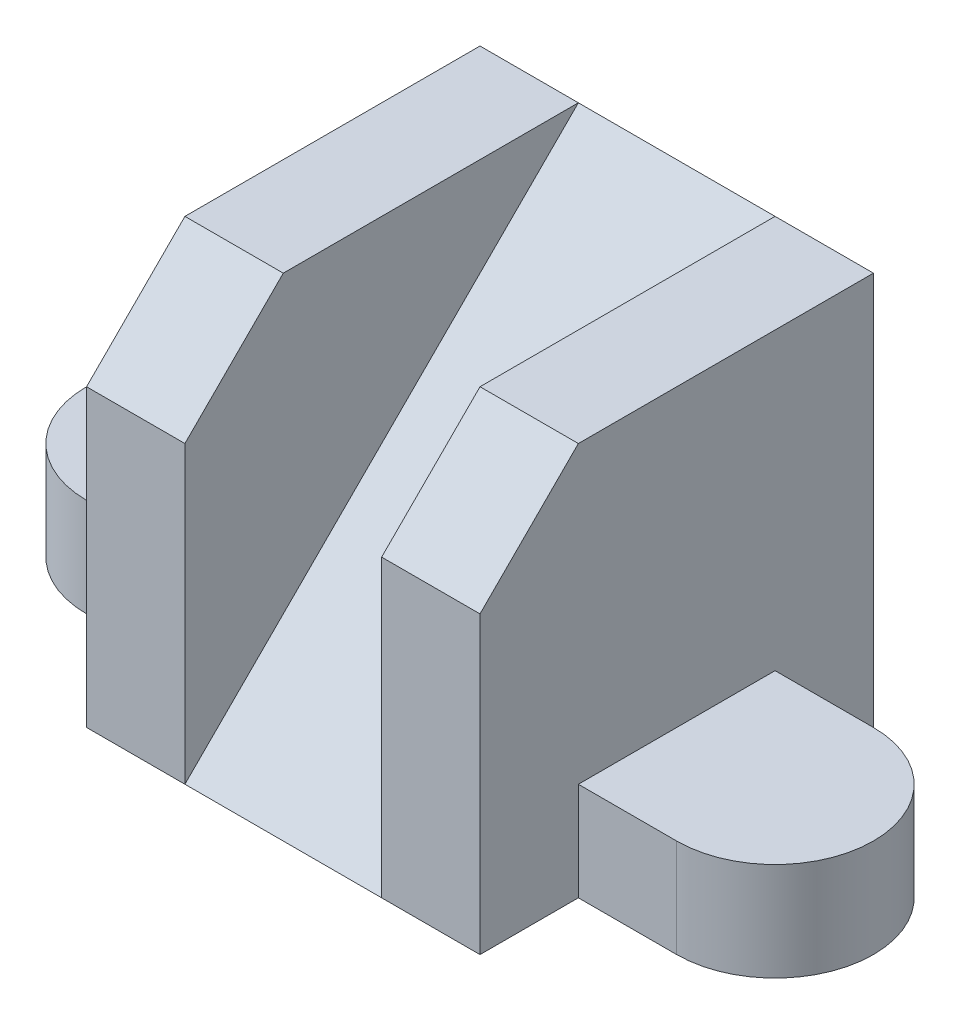
ISO-10303-21;
HEADER;
FILE_DESCRIPTION(('STEP AP214'),'2;1');
FILE_NAME('part.step','',(''),(''),'','','');
FILE_SCHEMA(('AUTOMOTIVE_DESIGN { 1 0 10303 214 1 1 1 1 }'));
ENDSEC;
DATA;
#1=APPLICATION_CONTEXT('core data for automotive mechanical design processes');
#2=APPLICATION_PROTOCOL_DEFINITION('international standard','automotive_design',2000,#1);
#3=PRODUCT_CONTEXT('',#1,'mechanical');
#4=PRODUCT('Part','Part','',(#3));
#5=PRODUCT_RELATED_PRODUCT_CATEGORY('part','',(#4));
#6=PRODUCT_DEFINITION_FORMATION('','',#4);
#7=PRODUCT_DEFINITION_CONTEXT('part definition',#1,'design');
#8=PRODUCT_DEFINITION('design','',#6,#7);
#9=PRODUCT_DEFINITION_SHAPE('','',#8);
#10=(LENGTH_UNIT() NAMED_UNIT(*) SI_UNIT(.MILLI.,.METRE.));
#11=(NAMED_UNIT(*) PLANE_ANGLE_UNIT() SI_UNIT($,.RADIAN.));
#12=(NAMED_UNIT(*) SI_UNIT($,.STERADIAN.) SOLID_ANGLE_UNIT());
#13=UNCERTAINTY_MEASURE_WITH_UNIT(LENGTH_MEASURE(1.E-05),#10,'distance_accuracy_value','');
#14=(GEOMETRIC_REPRESENTATION_CONTEXT(3) GLOBAL_UNCERTAINTY_ASSIGNED_CONTEXT((#13)) GLOBAL_UNIT_ASSIGNED_CONTEXT((#10,
#11,#12)) REPRESENTATION_CONTEXT('',''));
#15=CARTESIAN_POINT('',(0.,0.,0.));
#16=DIRECTION('',(0.,0.,1.));
#17=DIRECTION('',(1.,0.,0.));
#18=AXIS2_PLACEMENT_3D('',#15,#16,#17);
#19=CARTESIAN_POINT('',(14.,0.,0.));
#20=DIRECTION('',(-1.,0.,0.));
#21=DIRECTION('',(0.,0.,1.));
#22=AXIS2_PLACEMENT_3D('',#19,#20,#21);
#23=PLANE('',#22);
#24=DIRECTION('',(0.,-1.,0.));
#25=VECTOR('',#24,1.);
#26=CARTESIAN_POINT('',(14.,7.,7.));
#27=LINE('',#26,#25);
#28=CARTESIAN_POINT('',(14.,7.,7.));
#29=VERTEX_POINT('',#28);
#30=CARTESIAN_POINT('',(14.,0.,7.));
#31=VERTEX_POINT('',#30);
#32=EDGE_CURVE('E179',#29,#31,#27,.T.);
#33=ORIENTED_EDGE('',*,*,#32,.F.);
#34=DIRECTION('',(0.,0.,1.));
#35=VECTOR('',#34,1.);
#36=CARTESIAN_POINT('',(14.,7.,-7.));
#37=LINE('',#36,#35);
#38=CARTESIAN_POINT('',(14.,7.,-7.));
#39=VERTEX_POINT('',#38);
#40=EDGE_CURVE('E160',#39,#29,#37,.T.);
#41=ORIENTED_EDGE('',*,*,#40,.F.);
#42=DIRECTION('',(0.,-1.,0.));
#43=VECTOR('',#42,1.);
#44=CARTESIAN_POINT('',(14.,7.,-7.));
#45=LINE('',#44,#43);
#46=CARTESIAN_POINT('',(14.,0.,-7.));
#47=VERTEX_POINT('',#46);
#48=EDGE_CURVE('E157',#39,#47,#45,.T.);
#49=ORIENTED_EDGE('',*,*,#48,.T.);
#50=DIRECTION('',(0.,0.,-1.));
#51=VECTOR('',#50,1.);
#52=CARTESIAN_POINT('',(14.,0.,-14.));
#53=LINE('',#52,#51);
#54=CARTESIAN_POINT('',(14.,0.,-14.));
#55=VERTEX_POINT('',#54);
#56=EDGE_CURVE('E236',#47,#55,#53,.T.);
#57=ORIENTED_EDGE('',*,*,#56,.T.);
#58=DIRECTION('',(0.,1.,0.));
#59=VECTOR('',#58,1.);
#60=CARTESIAN_POINT('',(14.,28.,-14.));
#61=LINE('',#60,#59);
#62=CARTESIAN_POINT('',(14.,28.,-14.));
#63=VERTEX_POINT('',#62);
#64=EDGE_CURVE('E240',#55,#63,#61,.T.);
#65=ORIENTED_EDGE('',*,*,#64,.T.);
#66=DIRECTION('',(0.,0.,1.));
#67=VECTOR('',#66,1.);
#68=CARTESIAN_POINT('',(14.,28.,7.));
#69=LINE('',#68,#67);
#70=CARTESIAN_POINT('',(14.,28.,7.));
#71=VERTEX_POINT('',#70);
#72=EDGE_CURVE('E242',#63,#71,#69,.T.);
#73=ORIENTED_EDGE('',*,*,#72,.T.);
#74=DIRECTION('',(0.,-0.707106781186547,0.707106781186548));
#75=VECTOR('',#74,1.);
#76=CARTESIAN_POINT('',(14.,21.,14.));
#77=LINE('',#76,#75);
#78=CARTESIAN_POINT('',(14.,21.,14.));
#79=VERTEX_POINT('',#78);
#80=EDGE_CURVE('E230',#71,#79,#77,.T.);
#81=ORIENTED_EDGE('',*,*,#80,.T.);
#82=DIRECTION('',(0.,-1.,0.));
#83=VECTOR('',#82,1.);
#84=CARTESIAN_POINT('',(14.,0.,14.));
#85=LINE('',#84,#83);
#86=CARTESIAN_POINT('',(14.,0.,14.));
#87=VERTEX_POINT('',#86);
#88=EDGE_CURVE('E233',#79,#87,#85,.T.);
#89=ORIENTED_EDGE('',*,*,#88,.T.);
#90=EDGE_CURVE('E237',#87,#31,#53,.T.);
#91=ORIENTED_EDGE('',*,*,#90,.T.);
#92=EDGE_LOOP('',(#33,#41,#49,#57,#65,#73,#81,#89,#91));
#93=FACE_BOUND('',#92,.T.);
#94=ADVANCED_FACE('F33',(#93),#23,.F.);
#95=CARTESIAN_POINT('',(14.,21.,14.));
#96=DIRECTION('',(0.,-0.707106781186548,-0.707106781186548));
#97=DIRECTION('',(0.,0.707106781186547,-0.707106781186548));
#98=AXIS2_PLACEMENT_3D('',#95,#96,#97);
#99=PLANE('',#98);
#100=DIRECTION('',(0.,0.707106781186547,-0.707106781186548));
#101=VECTOR('',#100,1.);
#102=CARTESIAN_POINT('',(7.,21.,14.));
#103=LINE('',#102,#101);
#104=CARTESIAN_POINT('',(7.,21.,14.));
#105=VERTEX_POINT('',#104);
#106=CARTESIAN_POINT('',(7.,28.,7.));
#107=VERTEX_POINT('',#106);
#108=EDGE_CURVE('E223',#105,#107,#103,.T.);
#109=ORIENTED_EDGE('',*,*,#108,.F.);
#110=DIRECTION('',(-1.,0.,0.));
#111=VECTOR('',#110,1.);
#112=CARTESIAN_POINT('',(14.,21.,14.));
#113=LINE('',#112,#111);
#114=EDGE_CURVE('E11',#79,#105,#113,.T.);
#115=ORIENTED_EDGE('',*,*,#114,.F.);
#116=ORIENTED_EDGE('',*,*,#80,.F.);
#117=DIRECTION('',(-1.,0.,0.));
#118=VECTOR('',#117,1.);
#119=CARTESIAN_POINT('',(14.,28.,7.));
#120=LINE('',#119,#118);
#121=EDGE_CURVE('E259',#71,#107,#120,.T.);
#122=ORIENTED_EDGE('',*,*,#121,.T.);
#123=EDGE_LOOP('',(#109,#115,#116,#122));
#124=FACE_BOUND('',#123,.T.);
#125=ADVANCED_FACE('F332',(#124),#99,.F.);
#126=CARTESIAN_POINT('',(14.,0.,14.));
#127=DIRECTION('',(0.,0.,-1.));
#128=DIRECTION('',(-1.,0.,0.));
#129=AXIS2_PLACEMENT_3D('',#126,#127,#128);
#130=PLANE('',#129);
#131=DIRECTION('',(0.,-1.,0.));
#132=VECTOR('',#131,1.);
#133=CARTESIAN_POINT('',(7.,28.,14.));
#134=LINE('',#133,#132);
#135=CARTESIAN_POINT('',(7.,0.,14.));
#136=VERTEX_POINT('',#135);
#137=EDGE_CURVE('E204',#105,#136,#134,.T.);
#138=ORIENTED_EDGE('',*,*,#137,.T.);
#139=DIRECTION('',(-1.,0.,0.));
#140=VECTOR('',#139,1.);
#141=CARTESIAN_POINT('',(14.,0.,14.));
#142=LINE('',#141,#140);
#143=EDGE_CURVE('E269',#87,#136,#142,.T.);
#144=ORIENTED_EDGE('',*,*,#143,.F.);
#145=ORIENTED_EDGE('',*,*,#88,.F.);
#146=ORIENTED_EDGE('',*,*,#114,.T.);
#147=EDGE_LOOP('',(#138,#144,#145,#146));
#148=FACE_BOUND('',#147,.T.);
#149=ADVANCED_FACE('F325',(#148),#130,.F.);
#150=CARTESIAN_POINT('',(14.,28.,7.));
#151=DIRECTION('',(0.,-1.,0.));
#152=DIRECTION('',(0.,0.,-1.));
#153=AXIS2_PLACEMENT_3D('',#150,#151,#152);
#154=PLANE('',#153);
#155=DIRECTION('',(0.,0.,1.));
#156=VECTOR('',#155,1.);
#157=CARTESIAN_POINT('',(7.,28.,-14.));
#158=LINE('',#157,#156);
#159=CARTESIAN_POINT('',(7.,28.,-14.));
#160=VERTEX_POINT('',#159);
#161=EDGE_CURVE('E208',#160,#107,#158,.T.);
#162=ORIENTED_EDGE('',*,*,#161,.T.);
#163=ORIENTED_EDGE('',*,*,#121,.F.);
#164=ORIENTED_EDGE('',*,*,#72,.F.);
#165=DIRECTION('',(-1.,0.,0.));
#166=VECTOR('',#165,1.);
#167=CARTESIAN_POINT('',(14.,28.,-14.));
#168=LINE('',#167,#166);
#169=EDGE_CURVE('E263',#63,#160,#168,.T.);
#170=ORIENTED_EDGE('',*,*,#169,.T.);
#171=EDGE_LOOP('',(#162,#163,#164,#170));
#172=FACE_BOUND('',#171,.T.);
#173=ADVANCED_FACE('F336',(#172),#154,.F.);
#174=CARTESIAN_POINT('',(-7.,21.,14.));
#175=VERTEX_POINT('',#174);
#176=CARTESIAN_POINT('',(-14.,21.,14.));
#177=VERTEX_POINT('',#176);
#178=EDGE_CURVE('E41',#175,#177,#113,.T.);
#179=ORIENTED_EDGE('',*,*,#178,.F.);
#180=DIRECTION('',(0.,0.707106781186547,-0.707106781186548));
#181=VECTOR('',#180,1.);
#182=CARTESIAN_POINT('',(-7.,21.,14.));
#183=LINE('',#182,#181);
#184=CARTESIAN_POINT('',(-7.,28.,7.));
#185=VERTEX_POINT('',#184);
#186=EDGE_CURVE('E226',#175,#185,#183,.T.);
#187=ORIENTED_EDGE('',*,*,#186,.T.);
#188=CARTESIAN_POINT('',(-14.,28.,7.));
#189=VERTEX_POINT('',#188);
#190=EDGE_CURVE('E244',#185,#189,#120,.T.);
#191=ORIENTED_EDGE('',*,*,#190,.T.);
#192=DIRECTION('',(0.,-0.707106781186547,0.707106781186548));
#193=VECTOR('',#192,1.);
#194=CARTESIAN_POINT('',(-14.,21.,14.));
#195=LINE('',#194,#193);
#196=EDGE_CURVE('E229',#189,#177,#195,.T.);
#197=ORIENTED_EDGE('',*,*,#196,.T.);
#198=EDGE_LOOP('',(#179,#187,#191,#197));
#199=FACE_BOUND('',#198,.T.);
#200=ADVANCED_FACE('F35',(#199),#99,.F.);
#201=CARTESIAN_POINT('',(-7.,0.,14.));
#202=VERTEX_POINT('',#201);
#203=CARTESIAN_POINT('',(-14.,0.,14.));
#204=VERTEX_POINT('',#203);
#205=EDGE_CURVE('E268',#202,#204,#142,.T.);
#206=ORIENTED_EDGE('',*,*,#205,.F.);
#207=DIRECTION('',(0.,-1.,0.));
#208=VECTOR('',#207,1.);
#209=CARTESIAN_POINT('',(-7.,28.,14.));
#210=LINE('',#209,#208);
#211=EDGE_CURVE('E205',#175,#202,#210,.T.);
#212=ORIENTED_EDGE('',*,*,#211,.F.);
#213=ORIENTED_EDGE('',*,*,#178,.T.);
#214=DIRECTION('',(0.,-1.,0.));
#215=VECTOR('',#214,1.);
#216=CARTESIAN_POINT('',(-14.,0.,14.));
#217=LINE('',#216,#215);
#218=EDGE_CURVE('E247',#177,#204,#217,.T.);
#219=ORIENTED_EDGE('',*,*,#218,.T.);
#220=EDGE_LOOP('',(#206,#212,#213,#219));
#221=FACE_BOUND('',#220,.T.);
#222=ADVANCED_FACE('F281',(#221),#130,.F.);
#223=CARTESIAN_POINT('',(14.,0.,-14.));
#224=DIRECTION('',(0.,1.,0.));
#225=DIRECTION('',(0.,0.,1.));
#226=AXIS2_PLACEMENT_3D('',#223,#224,#225);
#227=PLANE('',#226);
#228=DIRECTION('',(0.,0.,-1.));
#229=VECTOR('',#228,1.);
#230=CARTESIAN_POINT('',(-14.,0.,-14.));
#231=LINE('',#230,#229);
#232=CARTESIAN_POINT('',(-14.,0.,7.));
#233=VERTEX_POINT('',#232);
#234=EDGE_CURVE('E251',#204,#233,#231,.T.);
#235=ORIENTED_EDGE('',*,*,#234,.T.);
#236=DIRECTION('',(1.,0.,0.));
#237=VECTOR('',#236,1.);
#238=CARTESIAN_POINT('',(-21.,0.,7.));
#239=LINE('',#238,#237);
#240=CARTESIAN_POINT('',(-21.,0.,7.));
#241=VERTEX_POINT('',#240);
#242=EDGE_CURVE('E56',#241,#233,#239,.T.);
#243=ORIENTED_EDGE('',*,*,#242,.F.);
#244=CARTESIAN_POINT('',(-21.,0.,0.));
#245=DIRECTION('',(0.,1.,0.));
#246=DIRECTION('',(0.,0.,1.));
#247=AXIS2_PLACEMENT_3D('',#244,#245,#246);
#248=CIRCLE('',#247,7.);
#249=CARTESIAN_POINT('',(-21.,0.,-7.));
#250=VERTEX_POINT('',#249);
#251=EDGE_CURVE('E175',#250,#241,#248,.T.);
#252=ORIENTED_EDGE('',*,*,#251,.F.);
#253=DIRECTION('',(-1.,0.,0.));
#254=VECTOR('',#253,1.);
#255=CARTESIAN_POINT('',(-21.,0.,-7.));
#256=LINE('',#255,#254);
#257=CARTESIAN_POINT('',(-14.,0.,-7.));
#258=VERTEX_POINT('',#257);
#259=EDGE_CURVE('E187',#258,#250,#256,.T.);
#260=ORIENTED_EDGE('',*,*,#259,.F.);
#261=CARTESIAN_POINT('',(-14.,0.,-14.));
#262=VERTEX_POINT('',#261);
#263=EDGE_CURVE('E250',#258,#262,#231,.T.);
#264=ORIENTED_EDGE('',*,*,#263,.T.);
#265=DIRECTION('',(-1.,0.,0.));
#266=VECTOR('',#265,1.);
#267=CARTESIAN_POINT('',(14.,0.,-14.));
#268=LINE('',#267,#266);
#269=EDGE_CURVE('E266',#55,#262,#268,.T.);
#270=ORIENTED_EDGE('',*,*,#269,.F.);
#271=ORIENTED_EDGE('',*,*,#56,.F.);
#272=DIRECTION('',(-1.,0.,0.));
#273=VECTOR('',#272,1.);
#274=CARTESIAN_POINT('',(21.,0.,-7.));
#275=LINE('',#274,#273);
#276=CARTESIAN_POINT('',(21.,0.,-7.));
#277=VERTEX_POINT('',#276);
#278=EDGE_CURVE('E48',#277,#47,#275,.T.);
#279=ORIENTED_EDGE('',*,*,#278,.F.);
#280=CARTESIAN_POINT('',(21.,0.,0.));
#281=DIRECTION('',(0.,1.,0.));
#282=DIRECTION('',(0.,0.,-1.));
#283=AXIS2_PLACEMENT_3D('',#280,#281,#282);
#284=CIRCLE('',#283,7.);
#285=CARTESIAN_POINT('',(21.,0.,7.));
#286=VERTEX_POINT('',#285);
#287=EDGE_CURVE('E174',#286,#277,#284,.T.);
#288=ORIENTED_EDGE('',*,*,#287,.F.);
#289=DIRECTION('',(1.,0.,0.));
#290=VECTOR('',#289,1.);
#291=CARTESIAN_POINT('',(21.,0.,7.));
#292=LINE('',#291,#290);
#293=EDGE_CURVE('E170',#31,#286,#292,.T.);
#294=ORIENTED_EDGE('',*,*,#293,.F.);
#295=ORIENTED_EDGE('',*,*,#90,.F.);
#296=ORIENTED_EDGE('',*,*,#143,.T.);
#297=DIRECTION('',(1.,0.,0.));
#298=VECTOR('',#297,1.);
#299=CARTESIAN_POINT('',(-7.,0.,14.));
#300=LINE('',#299,#298);
#301=EDGE_CURVE('E213',#202,#136,#300,.T.);
#302=ORIENTED_EDGE('',*,*,#301,.F.);
#303=ORIENTED_EDGE('',*,*,#205,.T.);
#304=EDGE_LOOP('',(#235,#243,#252,#260,#264,#270,#271,#279,#288,#294,#295,#296,#302,#303));
#305=FACE_BOUND('',#304,.T.);
#306=ADVANCED_FACE('F276',(#305),#227,.F.);
#307=CARTESIAN_POINT('',(14.,28.,-14.));
#308=DIRECTION('',(0.,0.,1.));
#309=DIRECTION('',(1.,0.,0.));
#310=AXIS2_PLACEMENT_3D('',#307,#308,#309);
#311=PLANE('',#310);
#312=DIRECTION('',(0.,1.,0.));
#313=VECTOR('',#312,1.);
#314=CARTESIAN_POINT('',(-14.,28.,-14.));
#315=LINE('',#314,#313);
#316=CARTESIAN_POINT('',(-14.,28.,-14.));
#317=VERTEX_POINT('',#316);
#318=EDGE_CURVE('E254',#262,#317,#315,.T.);
#319=ORIENTED_EDGE('',*,*,#318,.T.);
#320=CARTESIAN_POINT('',(-7.,28.,-14.));
#321=VERTEX_POINT('',#320);
#322=EDGE_CURVE('E262',#321,#317,#168,.T.);
#323=ORIENTED_EDGE('',*,*,#322,.F.);
#324=DIRECTION('',(1.,0.,0.));
#325=VECTOR('',#324,1.);
#326=CARTESIAN_POINT('',(-7.,28.,-14.));
#327=LINE('',#326,#325);
#328=EDGE_CURVE('E220',#321,#160,#327,.T.);
#329=ORIENTED_EDGE('',*,*,#328,.T.);
#330=ORIENTED_EDGE('',*,*,#169,.F.);
#331=ORIENTED_EDGE('',*,*,#64,.F.);
#332=ORIENTED_EDGE('',*,*,#269,.T.);
#333=EDGE_LOOP('',(#319,#323,#329,#330,#331,#332));
#334=FACE_BOUND('',#333,.T.);
#335=ADVANCED_FACE('F306',(#334),#311,.F.);
#336=ORIENTED_EDGE('',*,*,#190,.F.);
#337=DIRECTION('',(0.,0.,1.));
#338=VECTOR('',#337,1.);
#339=CARTESIAN_POINT('',(-7.,28.,-14.));
#340=LINE('',#339,#338);
#341=EDGE_CURVE('E211',#321,#185,#340,.T.);
#342=ORIENTED_EDGE('',*,*,#341,.F.);
#343=ORIENTED_EDGE('',*,*,#322,.T.);
#344=DIRECTION('',(0.,0.,1.));
#345=VECTOR('',#344,1.);
#346=CARTESIAN_POINT('',(-14.,28.,7.));
#347=LINE('',#346,#345);
#348=EDGE_CURVE('E234',#317,#189,#347,.T.);
#349=ORIENTED_EDGE('',*,*,#348,.T.);
#350=EDGE_LOOP('',(#336,#342,#343,#349));
#351=FACE_BOUND('',#350,.T.);
#352=ADVANCED_FACE('F345',(#351),#154,.F.);
#353=CARTESIAN_POINT('',(-14.,0.,0.));
#354=DIRECTION('',(-1.,0.,0.));
#355=DIRECTION('',(0.,0.,1.));
#356=AXIS2_PLACEMENT_3D('',#353,#354,#355);
#357=PLANE('',#356);
#358=DIRECTION('',(0.,-1.,0.));
#359=VECTOR('',#358,1.);
#360=CARTESIAN_POINT('',(-14.,7.,-7.));
#361=LINE('',#360,#359);
#362=CARTESIAN_POINT('',(-14.,7.,-7.));
#363=VERTEX_POINT('',#362);
#364=EDGE_CURVE('E198',#363,#258,#361,.T.);
#365=ORIENTED_EDGE('',*,*,#364,.F.);
#366=DIRECTION('',(0.,0.,-1.));
#367=VECTOR('',#366,1.);
#368=CARTESIAN_POINT('',(-14.,7.,-7.));
#369=LINE('',#368,#367);
#370=CARTESIAN_POINT('',(-14.,7.,7.));
#371=VERTEX_POINT('',#370);
#372=EDGE_CURVE('E189',#371,#363,#369,.T.);
#373=ORIENTED_EDGE('',*,*,#372,.F.);
#374=DIRECTION('',(0.,-1.,0.));
#375=VECTOR('',#374,1.);
#376=CARTESIAN_POINT('',(-14.,7.,7.));
#377=LINE('',#376,#375);
#378=EDGE_CURVE('E200',#371,#233,#377,.T.);
#379=ORIENTED_EDGE('',*,*,#378,.T.);
#380=ORIENTED_EDGE('',*,*,#234,.F.);
#381=ORIENTED_EDGE('',*,*,#218,.F.);
#382=ORIENTED_EDGE('',*,*,#196,.F.);
#383=ORIENTED_EDGE('',*,*,#348,.F.);
#384=ORIENTED_EDGE('',*,*,#318,.F.);
#385=ORIENTED_EDGE('',*,*,#263,.F.);
#386=EDGE_LOOP('',(#365,#373,#379,#380,#381,#382,#383,#384,#385));
#387=FACE_BOUND('',#386,.T.);
#388=ADVANCED_FACE('F286',(#387),#357,.T.);
#389=CARTESIAN_POINT('',(-7.,0.,0.));
#390=DIRECTION('',(-1.,0.,0.));
#391=DIRECTION('',(0.,0.,1.));
#392=AXIS2_PLACEMENT_3D('',#389,#390,#391);
#393=PLANE('',#392);
#394=ORIENTED_EDGE('',*,*,#211,.T.);
#395=DIRECTION('',(0.,0.707106781186547,-0.707106781186547));
#396=VECTOR('',#395,1.);
#397=CARTESIAN_POINT('',(-7.,0.,14.));
#398=LINE('',#397,#396);
#399=EDGE_CURVE('E207',#202,#321,#398,.T.);
#400=ORIENTED_EDGE('',*,*,#399,.T.);
#401=ORIENTED_EDGE('',*,*,#341,.T.);
#402=ORIENTED_EDGE('',*,*,#186,.F.);
#403=EDGE_LOOP('',(#394,#400,#401,#402));
#404=FACE_BOUND('',#403,.T.);
#405=ADVANCED_FACE('F342',(#404),#393,.F.);
#406=CARTESIAN_POINT('',(7.,0.,0.));
#407=DIRECTION('',(-1.,0.,0.));
#408=DIRECTION('',(0.,0.,1.));
#409=AXIS2_PLACEMENT_3D('',#406,#407,#408);
#410=PLANE('',#409);
#411=ORIENTED_EDGE('',*,*,#108,.T.);
#412=ORIENTED_EDGE('',*,*,#161,.F.);
#413=DIRECTION('',(0.,0.707106781186547,-0.707106781186547));
#414=VECTOR('',#413,1.);
#415=CARTESIAN_POINT('',(7.,0.,14.));
#416=LINE('',#415,#414);
#417=EDGE_CURVE('E216',#136,#160,#416,.T.);
#418=ORIENTED_EDGE('',*,*,#417,.F.);
#419=ORIENTED_EDGE('',*,*,#137,.F.);
#420=EDGE_LOOP('',(#411,#412,#418,#419));
#421=FACE_BOUND('',#420,.T.);
#422=ADVANCED_FACE('F329',(#421),#410,.T.);
#423=CARTESIAN_POINT('',(-7.,0.,14.));
#424=DIRECTION('',(0.,-0.707106781186548,-0.707106781186548));
#425=DIRECTION('',(0.,0.707106781186548,-0.707106781186548));
#426=AXIS2_PLACEMENT_3D('',#423,#424,#425);
#427=PLANE('',#426);
#428=ORIENTED_EDGE('',*,*,#417,.T.);
#429=ORIENTED_EDGE('',*,*,#328,.F.);
#430=ORIENTED_EDGE('',*,*,#399,.F.);
#431=ORIENTED_EDGE('',*,*,#301,.T.);
#432=EDGE_LOOP('',(#428,#429,#430,#431));
#433=FACE_BOUND('',#432,.T.);
#434=ADVANCED_FACE('F339',(#433),#427,.F.);
#435=CARTESIAN_POINT('',(-21.,7.,0.));
#436=DIRECTION('',(0.,-1.,0.));
#437=DIRECTION('',(0.,0.,-1.));
#438=AXIS2_PLACEMENT_3D('',#435,#436,#437);
#439=CYLINDRICAL_SURFACE('',#438,7.);
#440=ORIENTED_EDGE('',*,*,#251,.T.);
#441=DIRECTION('',(0.,-1.,0.));
#442=VECTOR('',#441,1.);
#443=CARTESIAN_POINT('',(-21.,7.,7.));
#444=LINE('',#443,#442);
#445=CARTESIAN_POINT('',(-21.,7.,7.));
#446=VERTEX_POINT('',#445);
#447=EDGE_CURVE('E202',#446,#241,#444,.T.);
#448=ORIENTED_EDGE('',*,*,#447,.F.);
#449=CARTESIAN_POINT('',(-21.,7.,0.));
#450=DIRECTION('',(0.,1.,0.));
#451=DIRECTION('',(0.,0.,1.));
#452=AXIS2_PLACEMENT_3D('',#449,#450,#451);
#453=CIRCLE('',#452,7.);
#454=CARTESIAN_POINT('',(-21.,7.,-7.));
#455=VERTEX_POINT('',#454);
#456=EDGE_CURVE('E183',#455,#446,#453,.T.);
#457=ORIENTED_EDGE('',*,*,#456,.F.);
#458=DIRECTION('',(0.,-1.,0.));
#459=VECTOR('',#458,1.);
#460=CARTESIAN_POINT('',(-21.,7.,-7.));
#461=LINE('',#460,#459);
#462=EDGE_CURVE('E192',#455,#250,#461,.T.);
#463=ORIENTED_EDGE('',*,*,#462,.T.);
#464=EDGE_LOOP('',(#440,#448,#457,#463));
#465=FACE_BOUND('',#464,.T.);
#466=ADVANCED_FACE('F296',(#465),#439,.T.);
#467=CARTESIAN_POINT('',(-21.,7.,7.));
#468=DIRECTION('',(0.,0.,-1.));
#469=DIRECTION('',(-1.,0.,0.));
#470=AXIS2_PLACEMENT_3D('',#467,#468,#469);
#471=PLANE('',#470);
#472=ORIENTED_EDGE('',*,*,#242,.T.);
#473=ORIENTED_EDGE('',*,*,#378,.F.);
#474=DIRECTION('',(1.,0.,0.));
#475=VECTOR('',#474,1.);
#476=CARTESIAN_POINT('',(-21.,7.,7.));
#477=LINE('',#476,#475);
#478=EDGE_CURVE('E186',#446,#371,#477,.T.);
#479=ORIENTED_EDGE('',*,*,#478,.F.);
#480=ORIENTED_EDGE('',*,*,#447,.T.);
#481=EDGE_LOOP('',(#472,#473,#479,#480));
#482=FACE_BOUND('',#481,.T.);
#483=ADVANCED_FACE('F288',(#482),#471,.F.);
#484=CARTESIAN_POINT('',(-21.,7.,-7.));
#485=DIRECTION('',(0.,0.,1.));
#486=DIRECTION('',(1.,0.,0.));
#487=AXIS2_PLACEMENT_3D('',#484,#485,#486);
#488=PLANE('',#487);
#489=ORIENTED_EDGE('',*,*,#259,.T.);
#490=ORIENTED_EDGE('',*,*,#462,.F.);
#491=DIRECTION('',(-1.,0.,0.));
#492=VECTOR('',#491,1.);
#493=CARTESIAN_POINT('',(-21.,7.,-7.));
#494=LINE('',#493,#492);
#495=EDGE_CURVE('E191',#363,#455,#494,.T.);
#496=ORIENTED_EDGE('',*,*,#495,.F.);
#497=ORIENTED_EDGE('',*,*,#364,.T.);
#498=EDGE_LOOP('',(#489,#490,#496,#497));
#499=FACE_BOUND('',#498,.T.);
#500=ADVANCED_FACE('F411',(#499),#488,.F.);
#501=CARTESIAN_POINT('',(-21.,7.,0.));
#502=DIRECTION('',(0.,1.,0.));
#503=DIRECTION('',(0.,0.,1.));
#504=AXIS2_PLACEMENT_3D('',#501,#502,#503);
#505=PLANE('',#504);
#506=ORIENTED_EDGE('',*,*,#456,.T.);
#507=ORIENTED_EDGE('',*,*,#478,.T.);
#508=ORIENTED_EDGE('',*,*,#372,.T.);
#509=ORIENTED_EDGE('',*,*,#495,.T.);
#510=EDGE_LOOP('',(#506,#507,#508,#509));
#511=FACE_BOUND('',#510,.T.);
#512=ADVANCED_FACE('F292',(#511),#505,.T.);
#513=CARTESIAN_POINT('',(21.,7.,0.));
#514=DIRECTION('',(0.,-1.,0.));
#515=DIRECTION('',(0.,0.,-1.));
#516=AXIS2_PLACEMENT_3D('',#513,#514,#515);
#517=CYLINDRICAL_SURFACE('',#516,7.);
#518=ORIENTED_EDGE('',*,*,#287,.T.);
#519=DIRECTION('',(0.,-1.,0.));
#520=VECTOR('',#519,1.);
#521=CARTESIAN_POINT('',(21.,7.,-7.));
#522=LINE('',#521,#520);
#523=CARTESIAN_POINT('',(21.,7.,-7.));
#524=VERTEX_POINT('',#523);
#525=EDGE_CURVE('E155',#524,#277,#522,.T.);
#526=ORIENTED_EDGE('',*,*,#525,.F.);
#527=CARTESIAN_POINT('',(21.,7.,0.));
#528=DIRECTION('',(0.,1.,0.));
#529=DIRECTION('',(0.,0.,-1.));
#530=AXIS2_PLACEMENT_3D('',#527,#528,#529);
#531=CIRCLE('',#530,7.);
#532=CARTESIAN_POINT('',(21.,7.,7.));
#533=VERTEX_POINT('',#532);
#534=EDGE_CURVE('E161',#533,#524,#531,.T.);
#535=ORIENTED_EDGE('',*,*,#534,.F.);
#536=DIRECTION('',(0.,-1.,0.));
#537=VECTOR('',#536,1.);
#538=CARTESIAN_POINT('',(21.,7.,7.));
#539=LINE('',#538,#537);
#540=EDGE_CURVE('E313',#533,#286,#539,.T.);
#541=ORIENTED_EDGE('',*,*,#540,.T.);
#542=EDGE_LOOP('',(#518,#526,#535,#541));
#543=FACE_BOUND('',#542,.T.);
#544=ADVANCED_FACE('F172',(#543),#517,.T.);
#545=CARTESIAN_POINT('',(21.,7.,-7.));
#546=DIRECTION('',(0.,0.,1.));
#547=DIRECTION('',(1.,0.,0.));
#548=AXIS2_PLACEMENT_3D('',#545,#546,#547);
#549=PLANE('',#548);
#550=ORIENTED_EDGE('',*,*,#278,.T.);
#551=ORIENTED_EDGE('',*,*,#48,.F.);
#552=DIRECTION('',(-1.,0.,0.));
#553=VECTOR('',#552,1.);
#554=CARTESIAN_POINT('',(21.,7.,-7.));
#555=LINE('',#554,#553);
#556=EDGE_CURVE('E151',#524,#39,#555,.T.);
#557=ORIENTED_EDGE('',*,*,#556,.F.);
#558=ORIENTED_EDGE('',*,*,#525,.T.);
#559=EDGE_LOOP('',(#550,#551,#557,#558));
#560=FACE_BOUND('',#559,.T.);
#561=ADVANCED_FACE('F153',(#560),#549,.F.);
#562=CARTESIAN_POINT('',(21.,7.,7.));
#563=DIRECTION('',(0.,0.,-1.));
#564=DIRECTION('',(-1.,0.,0.));
#565=AXIS2_PLACEMENT_3D('',#562,#563,#564);
#566=PLANE('',#565);
#567=ORIENTED_EDGE('',*,*,#293,.T.);
#568=ORIENTED_EDGE('',*,*,#540,.F.);
#569=DIRECTION('',(1.,0.,0.));
#570=VECTOR('',#569,1.);
#571=CARTESIAN_POINT('',(21.,7.,7.));
#572=LINE('',#571,#570);
#573=EDGE_CURVE('E166',#29,#533,#572,.T.);
#574=ORIENTED_EDGE('',*,*,#573,.F.);
#575=ORIENTED_EDGE('',*,*,#32,.T.);
#576=EDGE_LOOP('',(#567,#568,#574,#575));
#577=FACE_BOUND('',#576,.T.);
#578=ADVANCED_FACE('F321',(#577),#566,.F.);
#579=CARTESIAN_POINT('',(21.,7.,0.));
#580=DIRECTION('',(0.,-1.,0.));
#581=DIRECTION('',(0.,0.,-1.));
#582=AXIS2_PLACEMENT_3D('',#579,#580,#581);
#583=PLANE('',#582);
#584=ORIENTED_EDGE('',*,*,#534,.T.);
#585=ORIENTED_EDGE('',*,*,#556,.T.);
#586=ORIENTED_EDGE('',*,*,#40,.T.);
#587=ORIENTED_EDGE('',*,*,#573,.T.);
#588=EDGE_LOOP('',(#584,#585,#586,#587));
#589=FACE_BOUND('',#588,.T.);
#590=ADVANCED_FACE('F164',(#589),#583,.F.);
#591=CLOSED_SHELL('',(#94,#125,#149,#173,#200,#222,#306,#335,#352,#388,#405,#422,#434,#466,#483,
#500,#512,#544,#561,#578,#590));
#592=MANIFOLD_SOLID_BREP('B2',#591);
#593=ADVANCED_BREP_SHAPE_REPRESENTATION('',(#18,#592),#14);
#594=SHAPE_DEFINITION_REPRESENTATION(#9,#593);
ENDSEC;
END-ISO-10303-21;
